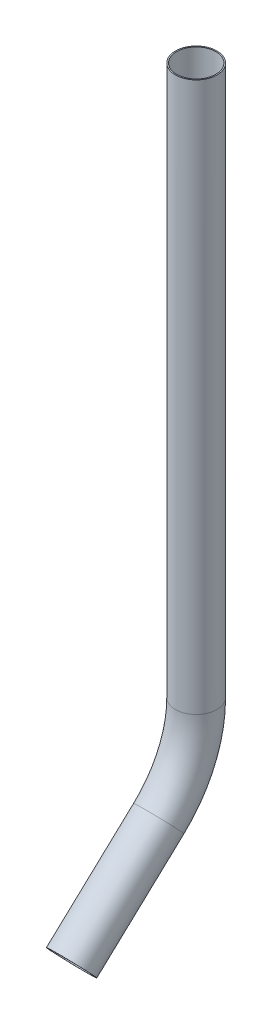
ISO-10303-21;
HEADER;
FILE_DESCRIPTION(('STEP AP214'),'2;1');
FILE_NAME('part.step','',(''),(''),'','','');
FILE_SCHEMA(('AUTOMOTIVE_DESIGN { 1 0 10303 214 1 1 1 1 }'));
ENDSEC;
DATA;
#1=APPLICATION_CONTEXT('core data for automotive mechanical design processes');
#2=APPLICATION_PROTOCOL_DEFINITION('international standard','automotive_design',2000,#1);
#3=PRODUCT_CONTEXT('',#1,'mechanical');
#4=PRODUCT('Part','Part','',(#3));
#5=PRODUCT_RELATED_PRODUCT_CATEGORY('part','',(#4));
#6=PRODUCT_DEFINITION_FORMATION('','',#4);
#7=PRODUCT_DEFINITION_CONTEXT('part definition',#1,'design');
#8=PRODUCT_DEFINITION('design','',#6,#7);
#9=PRODUCT_DEFINITION_SHAPE('','',#8);
#10=(LENGTH_UNIT() NAMED_UNIT(*) SI_UNIT(.MILLI.,.METRE.));
#11=(NAMED_UNIT(*) PLANE_ANGLE_UNIT() SI_UNIT($,.RADIAN.));
#12=(NAMED_UNIT(*) SI_UNIT($,.STERADIAN.) SOLID_ANGLE_UNIT());
#13=UNCERTAINTY_MEASURE_WITH_UNIT(LENGTH_MEASURE(1.E-05),#10,'distance_accuracy_value','');
#14=(GEOMETRIC_REPRESENTATION_CONTEXT(3) GLOBAL_UNCERTAINTY_ASSIGNED_CONTEXT((#13)) GLOBAL_UNIT_ASSIGNED_CONTEXT((#10,
#11,#12)) REPRESENTATION_CONTEXT('',''));
#15=CARTESIAN_POINT('',(0.,0.,0.));
#16=DIRECTION('',(0.,0.,1.));
#17=DIRECTION('',(1.,0.,0.));
#18=AXIS2_PLACEMENT_3D('',#15,#16,#17);
#19=CARTESIAN_POINT('',(0.,0.,0.));
#20=DIRECTION('',(0.,-1.,0.));
#21=DIRECTION('',(0.,0.,-1.));
#22=AXIS2_PLACEMENT_3D('',#19,#20,#21);
#23=CYLINDRICAL_SURFACE('',#22,6.731);
#24=CARTESIAN_POINT('',(0.,-177.8,0.));
#25=DIRECTION('',(0.,1.,0.));
#26=DIRECTION('',(0.,0.,1.));
#27=AXIS2_PLACEMENT_3D('',#24,#25,#26);
#28=CIRCLE('',#27,6.731);
#29=CARTESIAN_POINT('',(0.,-177.8,-6.73100000000002));
#30=VERTEX_POINT('',#29);
#31=EDGE_CURVE('E64',#30,#30,#28,.T.);
#32=ORIENTED_EDGE('',*,*,#31,.T.);
#33=EDGE_LOOP('',(#32));
#34=FACE_BOUND('',#33,.T.);
#35=CARTESIAN_POINT('',(0.,0.,0.));
#36=DIRECTION('',(0.,1.,0.));
#37=DIRECTION('',(0.,0.,1.));
#38=AXIS2_PLACEMENT_3D('',#35,#36,#37);
#39=CIRCLE('',#38,6.731);
#40=CARTESIAN_POINT('',(0.,0.,6.731));
#41=VERTEX_POINT('',#40);
#42=EDGE_CURVE('E61',#41,#41,#39,.T.);
#43=ORIENTED_EDGE('',*,*,#42,.F.);
#44=EDGE_LOOP('',(#43));
#45=FACE_BOUND('',#44,.T.);
#46=ADVANCED_FACE('F37',(#34,#45),#23,.T.);
#47=CARTESIAN_POINT('',(0.,-177.8,38.1));
#48=DIRECTION('',(-1.,0.,0.));
#49=DIRECTION('',(0.,0.,1.));
#50=AXIS2_PLACEMENT_3D('',#47,#48,#49);
#51=TOROIDAL_SURFACE('',#50,38.1,6.731);
#52=CARTESIAN_POINT('',(0.,-205.66177146489,12.112855277306));
#53=DIRECTION('',(0.,0.682077289309552,-0.731280090941996));
#54=DIRECTION('',(0.,0.731280090941995,0.682077289309552));
#55=AXIS2_PLACEMENT_3D('',#52,#53,#54);
#56=CIRCLE('',#55,6.731);
#57=CARTESIAN_POINT('',(0.,-210.584017757021,7.52179304296342));
#58=VERTEX_POINT('',#57);
#59=EDGE_CURVE('E41',#58,#58,#56,.T.);
#60=CARTESIAN_POINT('',(0.,-177.8,38.1));
#61=DIRECTION('',(-1.,0.,0.));
#62=DIRECTION('',(0.,0.,1.));
#63=AXIS2_PLACEMENT_3D('',#60,#61,#62);
#64=CIRCLE('',#63,44.831);
#65=EDGE_CURVE('',#30,#58,#64,.T.);
#66=ORIENTED_EDGE('',*,*,#31,.F.);
#67=ORIENTED_EDGE('',*,*,#59,.T.);
#68=ORIENTED_EDGE('',*,*,#65,.T.);
#69=ORIENTED_EDGE('',*,*,#65,.F.);
#70=EDGE_LOOP('',(#66,#68,#67,#69));
#71=FACE_BOUND('',#70,.T.);
#72=ADVANCED_FACE('F73',(#71),#51,.T.);
#73=CARTESIAN_POINT('',(0.,-205.66177146489,12.112855277306));
#74=DIRECTION('',(0.,-0.682077289309552,0.731280090941996));
#75=DIRECTION('',(0.,-0.731280090941996,-0.682077289309552));
#76=AXIS2_PLACEMENT_3D('',#73,#74,#75);
#77=CYLINDRICAL_SURFACE('',#76,6.731);
#78=CARTESIAN_POINT('',(0.,-231.966980477699,40.3156351391127));
#79=DIRECTION('',(0.,0.682077289309552,-0.731280090941996));
#80=DIRECTION('',(0.,0.731280090941996,0.682077289309552));
#81=AXIS2_PLACEMENT_3D('',#78,#79,#80);
#82=CIRCLE('',#81,6.731);
#83=CARTESIAN_POINT('',(0.,-227.044734185568,44.9066973734552));
#84=VERTEX_POINT('',#83);
#85=EDGE_CURVE('E56',#84,#84,#82,.T.);
#86=ORIENTED_EDGE('',*,*,#85,.T.);
#87=EDGE_LOOP('',(#86));
#88=FACE_BOUND('',#87,.T.);
#89=ORIENTED_EDGE('',*,*,#59,.F.);
#90=EDGE_LOOP('',(#89));
#91=FACE_BOUND('',#90,.T.);
#92=ADVANCED_FACE('F39',(#88,#91),#77,.T.);
#93=CARTESIAN_POINT('',(0.,0.,0.));
#94=DIRECTION('',(0.,1.,0.));
#95=DIRECTION('',(0.,0.,1.));
#96=AXIS2_PLACEMENT_3D('',#93,#94,#95);
#97=PLANE('',#96);
#98=CARTESIAN_POINT('',(0.,0.,0.));
#99=DIRECTION('',(0.,1.,0.));
#100=DIRECTION('',(0.,0.,1.));
#101=AXIS2_PLACEMENT_3D('',#98,#99,#100);
#102=CIRCLE('',#101,6.35);
#103=CARTESIAN_POINT('',(0.,0.,6.35));
#104=VERTEX_POINT('',#103);
#105=EDGE_CURVE('E60',#104,#104,#102,.F.);
#106=ORIENTED_EDGE('',*,*,#105,.T.);
#107=EDGE_LOOP('',(#106));
#108=FACE_BOUND('',#107,.T.);
#109=ORIENTED_EDGE('',*,*,#42,.T.);
#110=EDGE_LOOP('',(#109));
#111=FACE_BOUND('',#110,.T.);
#112=ADVANCED_FACE('F77',(#108,#111),#97,.T.);
#113=CARTESIAN_POINT('',(0.,-231.966980477699,40.3156351391127));
#114=DIRECTION('',(0.,0.682077289309552,-0.731280090941996));
#115=DIRECTION('',(0.,0.731280090941996,0.682077289309552));
#116=AXIS2_PLACEMENT_3D('',#113,#114,#115);
#117=PLANE('',#116);
#118=CARTESIAN_POINT('',(0.,-231.966980477699,40.3156351391127));
#119=DIRECTION('',(0.,0.682077289309552,-0.731280090941996));
#120=DIRECTION('',(0.,0.731280090941996,0.682077289309552));
#121=AXIS2_PLACEMENT_3D('',#118,#119,#120);
#122=CIRCLE('',#121,6.35);
#123=CARTESIAN_POINT('',(0.,-227.323351900217,44.6468259262283));
#124=VERTEX_POINT('',#123);
#125=EDGE_CURVE('E10',#124,#124,#122,.F.);
#126=ORIENTED_EDGE('',*,*,#125,.F.);
#127=EDGE_LOOP('',(#126));
#128=FACE_BOUND('',#127,.T.);
#129=ORIENTED_EDGE('',*,*,#85,.F.);
#130=EDGE_LOOP('',(#129));
#131=FACE_BOUND('',#130,.T.);
#132=ADVANCED_FACE('F83',(#128,#131),#117,.F.);
#133=CARTESIAN_POINT('',(0.,0.,0.));
#134=DIRECTION('',(0.,-1.,0.));
#135=DIRECTION('',(0.,0.,-1.));
#136=AXIS2_PLACEMENT_3D('',#133,#134,#135);
#137=CYLINDRICAL_SURFACE('',#136,6.35);
#138=CARTESIAN_POINT('',(0.,-177.8,0.));
#139=DIRECTION('',(0.,1.,0.));
#140=DIRECTION('',(0.,0.,1.));
#141=AXIS2_PLACEMENT_3D('',#138,#139,#140);
#142=CIRCLE('',#141,6.35);
#143=CARTESIAN_POINT('',(0.,-177.8,-6.35000000000002));
#144=VERTEX_POINT('',#143);
#145=EDGE_CURVE('E52',#144,#144,#142,.F.);
#146=ORIENTED_EDGE('',*,*,#145,.T.);
#147=EDGE_LOOP('',(#146));
#148=FACE_BOUND('',#147,.T.);
#149=ORIENTED_EDGE('',*,*,#105,.F.);
#150=EDGE_LOOP('',(#149));
#151=FACE_BOUND('',#150,.T.);
#152=ADVANCED_FACE('F93',(#148,#151),#137,.F.);
#153=CARTESIAN_POINT('',(0.,-177.8,38.1));
#154=DIRECTION('',(-1.,0.,0.));
#155=DIRECTION('',(0.,0.,1.));
#156=AXIS2_PLACEMENT_3D('',#153,#154,#155);
#157=TOROIDAL_SURFACE('',#156,38.1,6.35);
#158=CARTESIAN_POINT('',(0.,-205.66177146489,12.112855277306));
#159=DIRECTION('',(0.,0.682077289309552,-0.731280090941996));
#160=DIRECTION('',(0.,0.731280090941995,0.682077289309552));
#161=AXIS2_PLACEMENT_3D('',#158,#159,#160);
#162=CIRCLE('',#161,6.35);
#163=CARTESIAN_POINT('',(0.,-210.305400042372,7.78166449019036));
#164=VERTEX_POINT('',#163);
#165=EDGE_CURVE('E46',#164,#164,#162,.F.);
#166=CARTESIAN_POINT('',(0.,-177.8,38.1));
#167=DIRECTION('',(-1.,0.,0.));
#168=DIRECTION('',(0.,0.,1.));
#169=AXIS2_PLACEMENT_3D('',#166,#167,#168);
#170=CIRCLE('',#169,44.45);
#171=EDGE_CURVE('',#144,#164,#170,.T.);
#172=ORIENTED_EDGE('',*,*,#145,.F.);
#173=ORIENTED_EDGE('',*,*,#165,.T.);
#174=ORIENTED_EDGE('',*,*,#171,.T.);
#175=ORIENTED_EDGE('',*,*,#171,.F.);
#176=EDGE_LOOP('',(#172,#174,#173,#175));
#177=FACE_BOUND('',#176,.T.);
#178=ADVANCED_FACE('F88',(#177),#157,.F.);
#179=CARTESIAN_POINT('',(0.,-205.66177146489,12.112855277306));
#180=DIRECTION('',(0.,-0.682077289309552,0.731280090941996));
#181=DIRECTION('',(0.,-0.731280090941996,-0.682077289309552));
#182=AXIS2_PLACEMENT_3D('',#179,#180,#181);
#183=CYLINDRICAL_SURFACE('',#182,6.35);
#184=ORIENTED_EDGE('',*,*,#125,.T.);
#185=EDGE_LOOP('',(#184));
#186=FACE_BOUND('',#185,.T.);
#187=ORIENTED_EDGE('',*,*,#165,.F.);
#188=EDGE_LOOP('',(#187));
#189=FACE_BOUND('',#188,.T.);
#190=ADVANCED_FACE('F86',(#186,#189),#183,.F.);
#191=CLOSED_SHELL('',(#46,#72,#92,#112,#132,#152,#178,#190));
#192=MANIFOLD_SOLID_BREP('B2',#191);
#193=ADVANCED_BREP_SHAPE_REPRESENTATION('',(#18,#192),#14);
#194=SHAPE_DEFINITION_REPRESENTATION(#9,#193);
ENDSEC;
END-ISO-10303-21;
